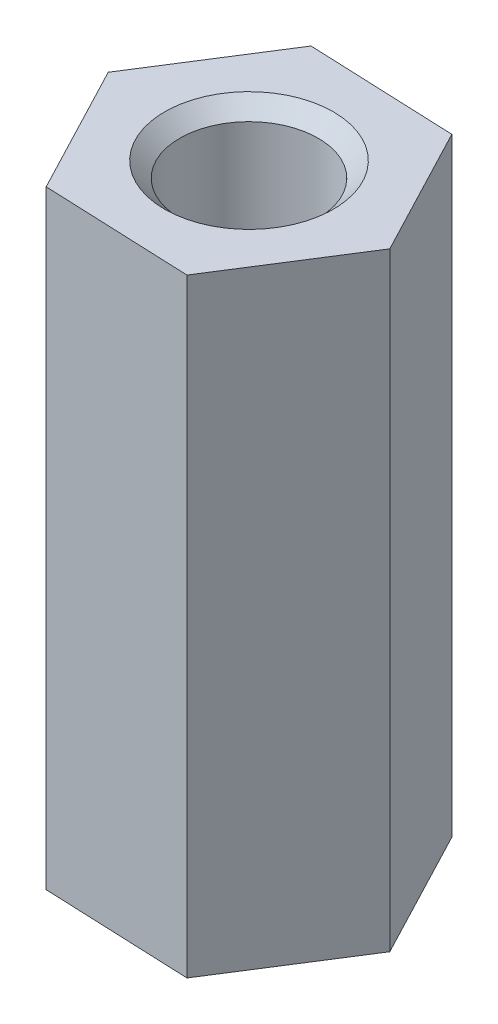
ISO-10303-21;
HEADER;
FILE_DESCRIPTION(('STEP AP214'),'2;1');
FILE_NAME('part.step','',(''),(''),'','','');
FILE_SCHEMA(('AUTOMOTIVE_DESIGN { 1 0 10303 214 1 1 1 1 }'));
ENDSEC;
DATA;
#1=APPLICATION_CONTEXT('core data for automotive mechanical design processes');
#2=APPLICATION_PROTOCOL_DEFINITION('international standard','automotive_design',2000,#1);
#3=PRODUCT_CONTEXT('',#1,'mechanical');
#4=PRODUCT('Part','Part','',(#3));
#5=PRODUCT_RELATED_PRODUCT_CATEGORY('part','',(#4));
#6=PRODUCT_DEFINITION_FORMATION('','',#4);
#7=PRODUCT_DEFINITION_CONTEXT('part definition',#1,'design');
#8=PRODUCT_DEFINITION('design','',#6,#7);
#9=PRODUCT_DEFINITION_SHAPE('','',#8);
#10=(LENGTH_UNIT() NAMED_UNIT(*) SI_UNIT(.MILLI.,.METRE.));
#11=(NAMED_UNIT(*) PLANE_ANGLE_UNIT() SI_UNIT($,.RADIAN.));
#12=(NAMED_UNIT(*) SI_UNIT($,.STERADIAN.) SOLID_ANGLE_UNIT());
#13=UNCERTAINTY_MEASURE_WITH_UNIT(LENGTH_MEASURE(1.E-05),#10,'distance_accuracy_value','');
#14=(GEOMETRIC_REPRESENTATION_CONTEXT(3) GLOBAL_UNCERTAINTY_ASSIGNED_CONTEXT((#13)) GLOBAL_UNIT_ASSIGNED_CONTEXT((#10,
#11,#12)) REPRESENTATION_CONTEXT('',''));
#15=CARTESIAN_POINT('',(0.,0.,0.));
#16=DIRECTION('',(0.,0.,1.));
#17=DIRECTION('',(1.,0.,0.));
#18=AXIS2_PLACEMENT_3D('',#15,#16,#17);
#19=CARTESIAN_POINT('',(0.,11.,0.));
#20=DIRECTION('',(0.,1.,0.));
#21=DIRECTION('',(0.,0.,1.));
#22=AXIS2_PLACEMENT_3D('',#19,#20,#21);
#23=PLANE('',#22);
#24=CARTESIAN_POINT('',(0.,11.,0.));
#25=DIRECTION('',(0.,1.,0.));
#26=DIRECTION('',(0.,0.,1.));
#27=AXIS2_PLACEMENT_3D('',#24,#25,#26);
#28=CIRCLE('',#27,1.525);
#29=CARTESIAN_POINT('',(0.,11.,1.525));
#30=VERTEX_POINT('',#29);
#31=EDGE_CURVE('E197',#30,#30,#28,.T.);
#32=ORIENTED_EDGE('',*,*,#31,.F.);
#33=EDGE_LOOP('',(#32));
#34=FACE_BOUND('',#33,.T.);
#35=DIRECTION('',(0.999145776971958,0.,0.0413245249107971));
#36=VECTOR('',#35,1.);
#37=CARTESIAN_POINT('',(-1.42181769887204,11.,2.24316021819832));
#38=LINE('',#37,#36);
#39=CARTESIAN_POINT('',(-1.42181769887204,11.,2.24316021819832));
#40=VERTEX_POINT('',#39);
#41=CARTESIAN_POINT('',(1.23172488428237,11.,2.35291035587268));
#42=VERTEX_POINT('',#41);
#43=EDGE_CURVE('E149',#40,#42,#38,.T.);
#44=ORIENTED_EDGE('',*,*,#43,.T.);
#45=DIRECTION('',(0.535360976858052,0.,-0.844623362486258));
#46=VECTOR('',#45,1.);
#47=CARTESIAN_POINT('',(1.23172488428237,11.,2.35291035587268));
#48=LINE('',#47,#46);
#49=CARTESIAN_POINT('',(2.65354258315441,11.,0.109750137674357));
#50=VERTEX_POINT('',#49);
#51=EDGE_CURVE('E98',#42,#50,#48,.T.);
#52=ORIENTED_EDGE('',*,*,#51,.T.);
#53=DIRECTION('',(-0.463784800113906,0.,-0.885947887397055));
#54=VECTOR('',#53,1.);
#55=CARTESIAN_POINT('',(2.65354258315441,11.,0.109750137674357));
#56=LINE('',#55,#54);
#57=CARTESIAN_POINT('',(1.42181769887204,11.,-2.24316021819832));
#58=VERTEX_POINT('',#57);
#59=EDGE_CURVE('E110',#50,#58,#56,.T.);
#60=ORIENTED_EDGE('',*,*,#59,.T.);
#61=DIRECTION('',(-0.999145776971957,0.,-0.0413245249107969));
#62=VECTOR('',#61,1.);
#63=CARTESIAN_POINT('',(1.42181769887204,11.,-2.24316021819832));
#64=LINE('',#63,#62);
#65=CARTESIAN_POINT('',(-1.23172488428237,11.,-2.35291035587268));
#66=VERTEX_POINT('',#65);
#67=EDGE_CURVE('E105',#58,#66,#64,.T.);
#68=ORIENTED_EDGE('',*,*,#67,.T.);
#69=DIRECTION('',(-0.535360976858052,0.,0.844623362486258));
#70=VECTOR('',#69,1.);
#71=CARTESIAN_POINT('',(-1.23172488428237,11.,-2.35291035587268));
#72=LINE('',#71,#70);
#73=CARTESIAN_POINT('',(-2.65354258315441,11.,-0.109750137674357));
#74=VERTEX_POINT('',#73);
#75=EDGE_CURVE('E108',#66,#74,#72,.T.);
#76=ORIENTED_EDGE('',*,*,#75,.T.);
#77=DIRECTION('',(0.463784800113906,0.,0.885947887397055));
#78=VECTOR('',#77,1.);
#79=CARTESIAN_POINT('',(-2.65354258315441,11.,-0.109750137674357));
#80=LINE('',#79,#78);
#81=EDGE_CURVE('E61',#74,#40,#80,.T.);
#82=ORIENTED_EDGE('',*,*,#81,.T.);
#83=EDGE_LOOP('',(#44,#52,#60,#68,#76,#82));
#84=FACE_BOUND('',#83,.T.);
#85=ADVANCED_FACE('F43',(#34,#84),#23,.T.);
#86=CARTESIAN_POINT('',(0.,0.,0.));
#87=DIRECTION('',(0.,1.,0.));
#88=DIRECTION('',(0.,0.,1.));
#89=AXIS2_PLACEMENT_3D('',#86,#87,#88);
#90=PLANE('',#89);
#91=CARTESIAN_POINT('',(0.,0.,0.));
#92=DIRECTION('',(0.,1.,0.));
#93=DIRECTION('',(0.,0.,1.));
#94=AXIS2_PLACEMENT_3D('',#91,#92,#93);
#95=CIRCLE('',#94,1.25);
#96=CARTESIAN_POINT('',(0.,0.,1.25));
#97=VERTEX_POINT('',#96);
#98=EDGE_CURVE('E137',#97,#97,#95,.T.);
#99=ORIENTED_EDGE('',*,*,#98,.T.);
#100=EDGE_LOOP('',(#99));
#101=FACE_BOUND('',#100,.T.);
#102=DIRECTION('',(0.999145776971958,0.,0.0413245249107971));
#103=VECTOR('',#102,1.);
#104=CARTESIAN_POINT('',(-1.42181769887204,0.,2.24316021819832));
#105=LINE('',#104,#103);
#106=CARTESIAN_POINT('',(-1.42181769887204,0.,2.24316021819832));
#107=VERTEX_POINT('',#106);
#108=CARTESIAN_POINT('',(1.23172488428237,0.,2.35291035587268));
#109=VERTEX_POINT('',#108);
#110=EDGE_CURVE('E132',#107,#109,#105,.T.);
#111=ORIENTED_EDGE('',*,*,#110,.F.);
#112=DIRECTION('',(0.463784800113906,0.,0.885947887397055));
#113=VECTOR('',#112,1.);
#114=CARTESIAN_POINT('',(-2.65354258315441,0.,-0.109750137674357));
#115=LINE('',#114,#113);
#116=CARTESIAN_POINT('',(-2.65354258315441,0.,-0.109750137674357));
#117=VERTEX_POINT('',#116);
#118=EDGE_CURVE('E90',#117,#107,#115,.T.);
#119=ORIENTED_EDGE('',*,*,#118,.F.);
#120=DIRECTION('',(-0.535360976858052,0.,0.844623362486258));
#121=VECTOR('',#120,1.);
#122=CARTESIAN_POINT('',(-1.23172488428237,0.,-2.35291035587268));
#123=LINE('',#122,#121);
#124=CARTESIAN_POINT('',(-1.23172488428237,0.,-2.35291035587268));
#125=VERTEX_POINT('',#124);
#126=EDGE_CURVE('E84',#125,#117,#123,.T.);
#127=ORIENTED_EDGE('',*,*,#126,.F.);
#128=DIRECTION('',(-0.999145776971957,0.,-0.0413245249107969));
#129=VECTOR('',#128,1.);
#130=CARTESIAN_POINT('',(1.42181769887204,0.,-2.24316021819832));
#131=LINE('',#130,#129);
#132=CARTESIAN_POINT('',(1.42181769887204,0.,-2.24316021819832));
#133=VERTEX_POINT('',#132);
#134=EDGE_CURVE('E119',#133,#125,#131,.T.);
#135=ORIENTED_EDGE('',*,*,#134,.F.);
#136=DIRECTION('',(-0.463784800113906,0.,-0.885947887397055));
#137=VECTOR('',#136,1.);
#138=CARTESIAN_POINT('',(2.65354258315441,0.,0.109750137674357));
#139=LINE('',#138,#137);
#140=CARTESIAN_POINT('',(2.65354258315441,0.,0.109750137674357));
#141=VERTEX_POINT('',#140);
#142=EDGE_CURVE('E140',#141,#133,#139,.T.);
#143=ORIENTED_EDGE('',*,*,#142,.F.);
#144=DIRECTION('',(0.535360976858052,0.,-0.844623362486258));
#145=VECTOR('',#144,1.);
#146=CARTESIAN_POINT('',(1.23172488428237,0.,2.35291035587268));
#147=LINE('',#146,#145);
#148=EDGE_CURVE('E136',#109,#141,#147,.T.);
#149=ORIENTED_EDGE('',*,*,#148,.F.);
#150=EDGE_LOOP('',(#111,#119,#127,#135,#143,#149));
#151=FACE_BOUND('',#150,.T.);
#152=ADVANCED_FACE('F162',(#101,#151),#90,.F.);
#153=CARTESIAN_POINT('',(-1.42181769887204,11.,2.24316021819832));
#154=DIRECTION('',(0.0413245249107971,0.,-0.999145776971958));
#155=DIRECTION('',(-0.999145776971958,0.,-0.0413245249107971));
#156=AXIS2_PLACEMENT_3D('',#153,#154,#155);
#157=PLANE('',#156);
#158=ORIENTED_EDGE('',*,*,#110,.T.);
#159=DIRECTION('',(0.,-1.,0.));
#160=VECTOR('',#159,1.);
#161=CARTESIAN_POINT('',(1.23172488428237,11.,2.35291035587268));
#162=LINE('',#161,#160);
#163=EDGE_CURVE('E11',#42,#109,#162,.T.);
#164=ORIENTED_EDGE('',*,*,#163,.F.);
#165=ORIENTED_EDGE('',*,*,#43,.F.);
#166=DIRECTION('',(0.,-1.,0.));
#167=VECTOR('',#166,1.);
#168=CARTESIAN_POINT('',(-1.42181769887204,11.,2.24316021819832));
#169=LINE('',#168,#167);
#170=EDGE_CURVE('E128',#40,#107,#169,.T.);
#171=ORIENTED_EDGE('',*,*,#170,.T.);
#172=EDGE_LOOP('',(#158,#164,#165,#171));
#173=FACE_BOUND('',#172,.T.);
#174=ADVANCED_FACE('F45',(#173),#157,.F.);
#175=CARTESIAN_POINT('',(1.23172488428237,11.,2.35291035587268));
#176=DIRECTION('',(-0.844623362486258,0.,-0.535360976858052));
#177=DIRECTION('',(-0.535360976858052,0.,0.844623362486258));
#178=AXIS2_PLACEMENT_3D('',#175,#176,#177);
#179=PLANE('',#178);
#180=ORIENTED_EDGE('',*,*,#148,.T.);
#181=DIRECTION('',(0.,-1.,0.));
#182=VECTOR('',#181,1.);
#183=CARTESIAN_POINT('',(2.65354258315441,11.,0.109750137674357));
#184=LINE('',#183,#182);
#185=EDGE_CURVE('E53',#50,#141,#184,.T.);
#186=ORIENTED_EDGE('',*,*,#185,.F.);
#187=ORIENTED_EDGE('',*,*,#51,.F.);
#188=ORIENTED_EDGE('',*,*,#163,.T.);
#189=EDGE_LOOP('',(#180,#186,#187,#188));
#190=FACE_BOUND('',#189,.T.);
#191=ADVANCED_FACE('F263',(#190),#179,.F.);
#192=CARTESIAN_POINT('',(2.65354258315441,11.,0.109750137674357));
#193=DIRECTION('',(-0.885947887397055,0.,0.463784800113906));
#194=DIRECTION('',(0.463784800113906,0.,0.885947887397055));
#195=AXIS2_PLACEMENT_3D('',#192,#193,#194);
#196=PLANE('',#195);
#197=ORIENTED_EDGE('',*,*,#142,.T.);
#198=DIRECTION('',(0.,-1.,0.));
#199=VECTOR('',#198,1.);
#200=CARTESIAN_POINT('',(1.42181769887204,11.,-2.24316021819832));
#201=LINE('',#200,#199);
#202=EDGE_CURVE('E121',#58,#133,#201,.T.);
#203=ORIENTED_EDGE('',*,*,#202,.F.);
#204=ORIENTED_EDGE('',*,*,#59,.F.);
#205=ORIENTED_EDGE('',*,*,#185,.T.);
#206=EDGE_LOOP('',(#197,#203,#204,#205));
#207=FACE_BOUND('',#206,.T.);
#208=ADVANCED_FACE('F159',(#207),#196,.F.);
#209=CARTESIAN_POINT('',(1.42181769887204,11.,-2.24316021819832));
#210=DIRECTION('',(-0.041324524910797,0.,0.999145776971958));
#211=DIRECTION('',(0.999145776971958,0.,0.041324524910797));
#212=AXIS2_PLACEMENT_3D('',#209,#210,#211);
#213=PLANE('',#212);
#214=ORIENTED_EDGE('',*,*,#134,.T.);
#215=DIRECTION('',(0.,-1.,0.));
#216=VECTOR('',#215,1.);
#217=CARTESIAN_POINT('',(-1.23172488428237,11.,-2.35291035587268));
#218=LINE('',#217,#216);
#219=EDGE_CURVE('E116',#66,#125,#218,.T.);
#220=ORIENTED_EDGE('',*,*,#219,.F.);
#221=ORIENTED_EDGE('',*,*,#67,.F.);
#222=ORIENTED_EDGE('',*,*,#202,.T.);
#223=EDGE_LOOP('',(#214,#220,#221,#222));
#224=FACE_BOUND('',#223,.T.);
#225=ADVANCED_FACE('F117',(#224),#213,.F.);
#226=CARTESIAN_POINT('',(-1.23172488428237,11.,-2.35291035587268));
#227=DIRECTION('',(0.844623362486258,0.,0.535360976858052));
#228=DIRECTION('',(0.535360976858052,0.,-0.844623362486258));
#229=AXIS2_PLACEMENT_3D('',#226,#227,#228);
#230=PLANE('',#229);
#231=ORIENTED_EDGE('',*,*,#126,.T.);
#232=DIRECTION('',(0.,-1.,0.));
#233=VECTOR('',#232,1.);
#234=CARTESIAN_POINT('',(-2.65354258315441,11.,-0.109750137674357));
#235=LINE('',#234,#233);
#236=EDGE_CURVE('E122',#74,#117,#235,.T.);
#237=ORIENTED_EDGE('',*,*,#236,.F.);
#238=ORIENTED_EDGE('',*,*,#75,.F.);
#239=ORIENTED_EDGE('',*,*,#219,.T.);
#240=EDGE_LOOP('',(#231,#237,#238,#239));
#241=FACE_BOUND('',#240,.T.);
#242=ADVANCED_FACE('F124',(#241),#230,.F.);
#243=CARTESIAN_POINT('',(-2.65354258315441,11.,-0.109750137674357));
#244=DIRECTION('',(0.885947887397055,0.,-0.463784800113906));
#245=DIRECTION('',(-0.463784800113906,0.,-0.885947887397055));
#246=AXIS2_PLACEMENT_3D('',#243,#244,#245);
#247=PLANE('',#246);
#248=ORIENTED_EDGE('',*,*,#118,.T.);
#249=ORIENTED_EDGE('',*,*,#170,.F.);
#250=ORIENTED_EDGE('',*,*,#81,.F.);
#251=ORIENTED_EDGE('',*,*,#236,.T.);
#252=EDGE_LOOP('',(#248,#249,#250,#251));
#253=FACE_BOUND('',#252,.T.);
#254=ADVANCED_FACE('F166',(#253),#247,.F.);
#255=CARTESIAN_POINT('',(0.,11.,0.));
#256=DIRECTION('',(0.,1.,0.));
#257=DIRECTION('',(0.,0.,1.));
#258=AXIS2_PLACEMENT_3D('',#255,#256,#257);
#259=CYLINDRICAL_SURFACE('',#258,1.25);
#260=ORIENTED_EDGE('',*,*,#98,.F.);
#261=EDGE_LOOP('',(#260));
#262=FACE_BOUND('',#261,.T.);
#263=CARTESIAN_POINT('',(0.,10.725,0.));
#264=DIRECTION('',(0.,1.,0.));
#265=DIRECTION('',(0.,0.,1.));
#266=AXIS2_PLACEMENT_3D('',#263,#264,#265);
#267=CIRCLE('',#266,1.25);
#268=CARTESIAN_POINT('',(0.,10.725,1.25));
#269=VERTEX_POINT('',#268);
#270=EDGE_CURVE('E195',#269,#269,#267,.T.);
#271=ORIENTED_EDGE('',*,*,#270,.T.);
#272=EDGE_LOOP('',(#271));
#273=FACE_BOUND('',#272,.T.);
#274=ADVANCED_FACE('F168',(#262,#273),#259,.F.);
#275=CARTESIAN_POINT('',(0.,11.,0.));
#276=DIRECTION('',(0.,1.,0.));
#277=DIRECTION('',(0.,0.,1.));
#278=AXIS2_PLACEMENT_3D('',#275,#276,#277);
#279=CONICAL_SURFACE('',#278,1.525,0.785398163397448);
#280=ORIENTED_EDGE('',*,*,#270,.F.);
#281=EDGE_LOOP('',(#280));
#282=FACE_BOUND('',#281,.T.);
#283=ORIENTED_EDGE('',*,*,#31,.T.);
#284=EDGE_LOOP('',(#283));
#285=FACE_BOUND('',#284,.T.);
#286=ADVANCED_FACE('F174',(#282,#285),#279,.F.);
#287=CLOSED_SHELL('',(#85,#152,#174,#191,#208,#225,#242,#254,#274,#286));
#288=MANIFOLD_SOLID_BREP('B2',#287);
#289=ADVANCED_BREP_SHAPE_REPRESENTATION('',(#18,#288),#14);
#290=SHAPE_DEFINITION_REPRESENTATION(#9,#289);
ENDSEC;
END-ISO-10303-21;
